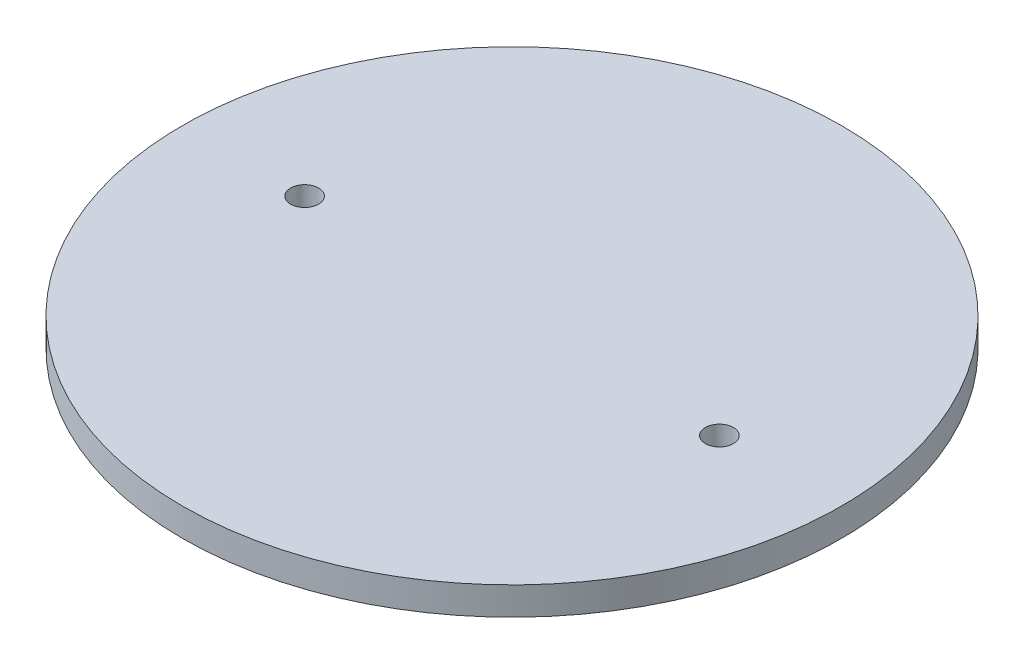
ISO-10303-21;
HEADER;
FILE_DESCRIPTION(('STEP AP214'),'2;1');
FILE_NAME('part.step','',(''),(''),'','','');
FILE_SCHEMA(('AUTOMOTIVE_DESIGN { 1 0 10303 214 1 1 1 1 }'));
ENDSEC;
DATA;
#1=APPLICATION_CONTEXT('core data for automotive mechanical design processes');
#2=APPLICATION_PROTOCOL_DEFINITION('international standard','automotive_design',2000,#1);
#3=PRODUCT_CONTEXT('',#1,'mechanical');
#4=PRODUCT('Part','Part','',(#3));
#5=PRODUCT_RELATED_PRODUCT_CATEGORY('part','',(#4));
#6=PRODUCT_DEFINITION_FORMATION('','',#4);
#7=PRODUCT_DEFINITION_CONTEXT('part definition',#1,'design');
#8=PRODUCT_DEFINITION('design','',#6,#7);
#9=PRODUCT_DEFINITION_SHAPE('','',#8);
#10=(LENGTH_UNIT() NAMED_UNIT(*) SI_UNIT(.MILLI.,.METRE.));
#11=(NAMED_UNIT(*) PLANE_ANGLE_UNIT() SI_UNIT($,.RADIAN.));
#12=(NAMED_UNIT(*) SI_UNIT($,.STERADIAN.) SOLID_ANGLE_UNIT());
#13=UNCERTAINTY_MEASURE_WITH_UNIT(LENGTH_MEASURE(1.E-05),#10,'distance_accuracy_value','');
#14=(GEOMETRIC_REPRESENTATION_CONTEXT(3) GLOBAL_UNCERTAINTY_ASSIGNED_CONTEXT((#13)) GLOBAL_UNIT_ASSIGNED_CONTEXT((#10,
#11,#12)) REPRESENTATION_CONTEXT('',''));
#15=CARTESIAN_POINT('',(0.,0.,0.));
#16=DIRECTION('',(0.,0.,1.));
#17=DIRECTION('',(1.,0.,0.));
#18=AXIS2_PLACEMENT_3D('',#15,#16,#17);
#19=CARTESIAN_POINT('',(0.,6.35,0.));
#20=DIRECTION('',(0.,-1.,0.));
#21=DIRECTION('',(0.,0.,-1.));
#22=AXIS2_PLACEMENT_3D('',#19,#20,#21);
#23=CYLINDRICAL_SURFACE('',#22,74.676);
#24=CARTESIAN_POINT('',(0.,6.35,0.));
#25=DIRECTION('',(0.,1.,0.));
#26=DIRECTION('',(0.,0.,1.));
#27=AXIS2_PLACEMENT_3D('',#24,#25,#26);
#28=CIRCLE('',#27,74.676);
#29=CARTESIAN_POINT('',(0.,6.35,74.676));
#30=VERTEX_POINT('',#29);
#31=EDGE_CURVE('E10',#30,#30,#28,.T.);
#32=ORIENTED_EDGE('',*,*,#31,.F.);
#33=EDGE_LOOP('',(#32));
#34=FACE_BOUND('',#33,.T.);
#35=CARTESIAN_POINT('',(0.,0.,0.));
#36=DIRECTION('',(0.,1.,0.));
#37=DIRECTION('',(0.,0.,1.));
#38=AXIS2_PLACEMENT_3D('',#35,#36,#37);
#39=CIRCLE('',#38,74.676);
#40=CARTESIAN_POINT('',(0.,0.,74.676));
#41=VERTEX_POINT('',#40);
#42=EDGE_CURVE('E38',#41,#41,#39,.T.);
#43=ORIENTED_EDGE('',*,*,#42,.T.);
#44=EDGE_LOOP('',(#43));
#45=FACE_BOUND('',#44,.T.);
#46=ADVANCED_FACE('F35',(#34,#45),#23,.T.);
#47=CARTESIAN_POINT('',(0.,6.35,0.));
#48=DIRECTION('',(0.,1.,0.));
#49=DIRECTION('',(0.,0.,1.));
#50=AXIS2_PLACEMENT_3D('',#47,#48,#49);
#51=PLANE('',#50);
#52=CARTESIAN_POINT('',(46.99,6.35,0.));
#53=DIRECTION('',(0.,1.,0.));
#54=DIRECTION('',(0.,0.,-1.));
#55=AXIS2_PLACEMENT_3D('',#52,#53,#54);
#56=CIRCLE('',#55,3.175);
#57=CARTESIAN_POINT('',(46.99,6.35,-3.17500000000001));
#58=VERTEX_POINT('',#57);
#59=EDGE_CURVE('E55',#58,#58,#56,.T.);
#60=ORIENTED_EDGE('',*,*,#59,.F.);
#61=EDGE_LOOP('',(#60));
#62=FACE_BOUND('',#61,.T.);
#63=CARTESIAN_POINT('',(-46.99,6.35,0.));
#64=DIRECTION('',(0.,1.,0.));
#65=DIRECTION('',(0.,0.,1.));
#66=AXIS2_PLACEMENT_3D('',#63,#64,#65);
#67=CIRCLE('',#66,3.175);
#68=CARTESIAN_POINT('',(-46.99,6.35,3.175));
#69=VERTEX_POINT('',#68);
#70=EDGE_CURVE('E49',#69,#69,#67,.T.);
#71=ORIENTED_EDGE('',*,*,#70,.F.);
#72=EDGE_LOOP('',(#71));
#73=FACE_BOUND('',#72,.T.);
#74=ORIENTED_EDGE('',*,*,#31,.T.);
#75=EDGE_LOOP('',(#74));
#76=FACE_BOUND('',#75,.T.);
#77=ADVANCED_FACE('F61',(#62,#73,#76),#51,.T.);
#78=CARTESIAN_POINT('',(0.,0.,0.));
#79=DIRECTION('',(0.,1.,0.));
#80=DIRECTION('',(0.,0.,1.));
#81=AXIS2_PLACEMENT_3D('',#78,#79,#80);
#82=PLANE('',#81);
#83=CARTESIAN_POINT('',(46.99,0.,0.));
#84=DIRECTION('',(0.,1.,0.));
#85=DIRECTION('',(0.,0.,1.));
#86=AXIS2_PLACEMENT_3D('',#83,#84,#85);
#87=CIRCLE('',#86,3.175);
#88=CARTESIAN_POINT('',(46.99,0.,3.17499999999999));
#89=VERTEX_POINT('',#88);
#90=EDGE_CURVE('E52',#89,#89,#87,.F.);
#91=ORIENTED_EDGE('',*,*,#90,.F.);
#92=EDGE_LOOP('',(#91));
#93=FACE_BOUND('',#92,.T.);
#94=CARTESIAN_POINT('',(-46.99,0.,0.));
#95=DIRECTION('',(0.,1.,0.));
#96=DIRECTION('',(0.,0.,1.));
#97=AXIS2_PLACEMENT_3D('',#94,#95,#96);
#98=CIRCLE('',#97,3.175);
#99=CARTESIAN_POINT('',(-46.99,0.,3.175));
#100=VERTEX_POINT('',#99);
#101=EDGE_CURVE('E45',#100,#100,#98,.F.);
#102=ORIENTED_EDGE('',*,*,#101,.F.);
#103=EDGE_LOOP('',(#102));
#104=FACE_BOUND('',#103,.T.);
#105=ORIENTED_EDGE('',*,*,#42,.F.);
#106=EDGE_LOOP('',(#105));
#107=FACE_BOUND('',#106,.T.);
#108=ADVANCED_FACE('F64',(#93,#104,#107),#82,.F.);
#109=CARTESIAN_POINT('',(-46.99,-8.98025612106915,0.));
#110=DIRECTION('',(0.,1.,0.));
#111=DIRECTION('',(0.,0.,1.));
#112=AXIS2_PLACEMENT_3D('',#109,#110,#111);
#113=CYLINDRICAL_SURFACE('',#112,3.175);
#114=ORIENTED_EDGE('',*,*,#101,.T.);
#115=EDGE_LOOP('',(#114));
#116=FACE_BOUND('',#115,.T.);
#117=ORIENTED_EDGE('',*,*,#70,.T.);
#118=EDGE_LOOP('',(#117));
#119=FACE_BOUND('',#118,.T.);
#120=ADVANCED_FACE('F68',(#116,#119),#113,.F.);
#121=CARTESIAN_POINT('',(46.99,-8.98025612106915,0.));
#122=DIRECTION('',(0.,1.,0.));
#123=DIRECTION('',(0.,0.,1.));
#124=AXIS2_PLACEMENT_3D('',#121,#122,#123);
#125=CYLINDRICAL_SURFACE('',#124,3.175);
#126=ORIENTED_EDGE('',*,*,#90,.T.);
#127=EDGE_LOOP('',(#126));
#128=FACE_BOUND('',#127,.T.);
#129=ORIENTED_EDGE('',*,*,#59,.T.);
#130=EDGE_LOOP('',(#129));
#131=FACE_BOUND('',#130,.T.);
#132=ADVANCED_FACE('F59',(#128,#131),#125,.F.);
#133=CLOSED_SHELL('',(#46,#77,#108,#120,#132));
#134=MANIFOLD_SOLID_BREP('B2',#133);
#135=ADVANCED_BREP_SHAPE_REPRESENTATION('',(#18,#134),#14);
#136=SHAPE_DEFINITION_REPRESENTATION(#9,#135);
ENDSEC;
END-ISO-10303-21;
